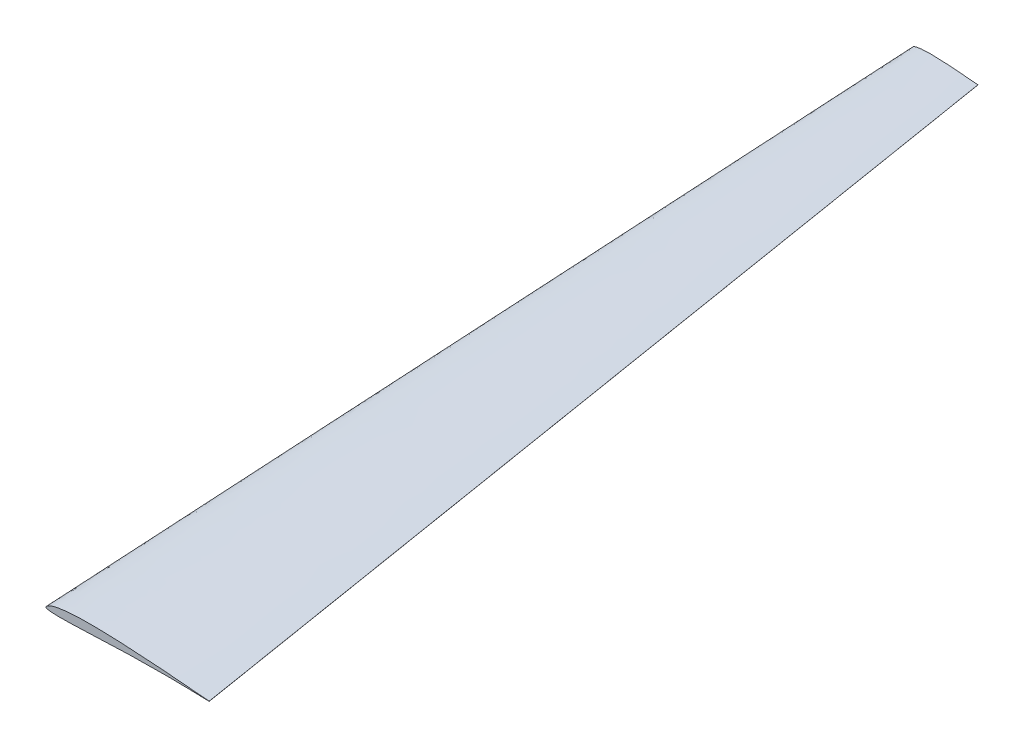
ISO-10303-21;
HEADER;
FILE_DESCRIPTION(('STEP AP214'),'2;1');
FILE_NAME('part.step','',(''),(''),'','','');
FILE_SCHEMA(('AUTOMOTIVE_DESIGN { 1 0 10303 214 1 1 1 1 }'));
ENDSEC;
DATA;
#1=APPLICATION_CONTEXT('core data for automotive mechanical design processes');
#2=APPLICATION_PROTOCOL_DEFINITION('international standard','automotive_design',2000,#1);
#3=PRODUCT_CONTEXT('',#1,'mechanical');
#4=PRODUCT('Part','Part','',(#3));
#5=PRODUCT_RELATED_PRODUCT_CATEGORY('part','',(#4));
#6=PRODUCT_DEFINITION_FORMATION('','',#4);
#7=PRODUCT_DEFINITION_CONTEXT('part definition',#1,'design');
#8=PRODUCT_DEFINITION('design','',#6,#7);
#9=PRODUCT_DEFINITION_SHAPE('','',#8);
#10=(LENGTH_UNIT() NAMED_UNIT(*) SI_UNIT(.MILLI.,.METRE.));
#11=(NAMED_UNIT(*) PLANE_ANGLE_UNIT() SI_UNIT($,.RADIAN.));
#12=(NAMED_UNIT(*) SI_UNIT($,.STERADIAN.) SOLID_ANGLE_UNIT());
#13=UNCERTAINTY_MEASURE_WITH_UNIT(LENGTH_MEASURE(1.E-05),#10,'distance_accuracy_value','');
#14=(GEOMETRIC_REPRESENTATION_CONTEXT(3) GLOBAL_UNCERTAINTY_ASSIGNED_CONTEXT((#13)) GLOBAL_UNIT_ASSIGNED_CONTEXT((#10,
#11,#12)) REPRESENTATION_CONTEXT('',''));
#15=CARTESIAN_POINT('',(0.,0.,0.));
#16=DIRECTION('',(0.,0.,1.));
#17=DIRECTION('',(1.,0.,0.));
#18=AXIS2_PLACEMENT_3D('',#15,#16,#17);
#19=CARTESIAN_POINT('',(60.0537332262467,91.7339972019544,-471.181048054879));
#20=DIRECTION('',(0.,0.,-1.));
#21=DIRECTION('',(-1.,0.,0.));
#22=AXIS2_PLACEMENT_3D('',#19,#20,#21);
#23=PLANE('',#22);
#24=CARTESIAN_POINT('',(99.9999999999999,91.6071177807418,-471.181048054879));
#25=CARTESIAN_POINT('',(96.8130845421146,91.9159161264516,-471.181048054879));
#26=CARTESIAN_POINT('',(90.8516017774765,92.4239674434614,-471.181048054879));
#27=CARTESIAN_POINT('',(83.0425550712482,93.0205608630696,-471.181048054879));
#28=CARTESIAN_POINT('',(76.7662191941969,93.3726710123304,-471.181048054879));
#29=CARTESIAN_POINT('',(71.9857527432553,93.5113728009834,-471.181048054879));
#30=CARTESIAN_POINT('',(68.1511854600101,93.4632955275076,-471.181048054879));
#31=CARTESIAN_POINT('',(65.4489732022514,93.2824054825393,-471.181048054879));
#32=CARTESIAN_POINT('',(63.5228856187694,93.0359983920731,-471.181048054879));
#33=CARTESIAN_POINT('',(62.0660229834825,92.7412102788768,-471.181048054879));
#34=CARTESIAN_POINT('',(60.9781681661375,92.3972311290684,-471.181048054879));
#35=CARTESIAN_POINT('',(60.3272429311943,92.0202378313688,-471.181048054879));
#36=CARTESIAN_POINT('',(60.070984151851,91.7932099307185,-471.181048054879));
#37=CARTESIAN_POINT('',(59.9677606236837,91.5582979381846,-471.181048054879));
#38=CARTESIAN_POINT('',(60.259069260349,91.2563320838473,-471.181048054879));
#39=CARTESIAN_POINT('',(61.0638038341098,91.1285470761483,-471.181048054879));
#40=CARTESIAN_POINT('',(62.6625241862733,90.9022574837296,-471.181048054879));
#41=CARTESIAN_POINT('',(69.5937623498145,90.84468793336,-471.181048054879));
#42=CARTESIAN_POINT('',(78.033126521504,91.4353540552512,-471.181048054879));
#43=CARTESIAN_POINT('',(89.7307037407105,91.7487402009355,-471.181048054879));
#44=CARTESIAN_POINT('',(95.8836565315395,91.6737997241128,-471.181048054879));
#45=CARTESIAN_POINT('',(99.9999999999999,91.5695177807418,-471.181048054879));
#46=B_SPLINE_CURVE_WITH_KNOTS('',3,(#24,#25,#26,#27,#28,#29,#30,#31,#32,#33,#34,#35,#36,#37,#38,
#39,#40,#41,#42,#43,#44,#45),.UNSPECIFIED.,.F.,.F.,(4,1,1,1,1,1,1,1,1,1,1,1,1,1,1,1,1,1,1,4),
(0.,0.119083164717175,0.222520124433715,0.2912733453482,0.352866803612905,0.400365287570826,
0.433855393085576,0.453552748389118,0.472540106699217,0.489120782233272,0.495803553550714,
0.500290804141686,0.501939697087531,0.504569258270676,0.514306552104738,0.531773804943749,
0.564929640012207,0.771159197280141,0.846855431295102,1.),.UNSPECIFIED.);
#47=CARTESIAN_POINT('',(99.9999999999999,91.6071177807418,-471.181048054879));
#48=VERTEX_POINT('',#47);
#49=CARTESIAN_POINT('',(99.9999999999999,91.5695177807418,-471.181048054879));
#50=VERTEX_POINT('',#49);
#51=EDGE_CURVE('E59',#48,#50,#46,.T.);
#52=ORIENTED_EDGE('',*,*,#51,.F.);
#53=DIRECTION('',(0.,1.,0.));
#54=VECTOR('',#53,1.);
#55=CARTESIAN_POINT('',(99.9999999999999,91.6071177807418,-471.181048054879));
#56=LINE('',#55,#54);
#57=EDGE_CURVE('E12',#50,#48,#56,.T.);
#58=ORIENTED_EDGE('',*,*,#57,.F.);
#59=EDGE_LOOP('',(#52,#58));
#60=FACE_BOUND('',#59,.T.);
#61=ADVANCED_FACE('F49',(#60),#23,.T.);
#62=CARTESIAN_POINT('',(0.149701114740626,0.382710896466182,0.));
#63=DIRECTION('',(0.,0.,-1.));
#64=DIRECTION('',(-1.,0.,0.));
#65=AXIS2_PLACEMENT_3D('',#62,#63,#64);
#66=PLANE('',#65);
#67=CARTESIAN_POINT('',(100.,0.048,0.));
#68=CARTESIAN_POINT('',(95.7678090600866,0.466238224355455,0.));
#69=CARTESIAN_POINT('',(86.9629866780535,1.28166045616531,0.));
#70=CARTESIAN_POINT('',(73.5755783965031,2.33883275981655,0.));
#71=CARTESIAN_POINT('',(60.7669928543316,3.25411780684955,0.));
#72=CARTESIAN_POINT('',(49.7892813180739,3.89651845544394,0.));
#73=CARTESIAN_POINT('',(41.1057660236439,4.29113693338756,0.));
#74=CARTESIAN_POINT('',(33.8066649059363,4.51482650584163,0.));
#75=CARTESIAN_POINT('',(27.4373491993857,4.59265437301291,0.));
#76=CARTESIAN_POINT('',(21.998770095792,4.52893409379901,0.));
#77=CARTESIAN_POINT('',(17.4976897869706,4.35664490194256,0.));
#78=CARTESIAN_POINT('',(13.9280867229625,4.11310217417087,0.));
#79=CARTESIAN_POINT('',(10.8450947445525,3.79431573645231,0.));
#80=CARTESIAN_POINT('',(8.25973648829716,3.43168371237338,0.));
#81=CARTESIAN_POINT('',(5.77165713087808,2.95553363332165,0.));
#82=CARTESIAN_POINT('',(3.81117060933852,2.42957189849011,0.));
#83=CARTESIAN_POINT('',(2.41154339976418,1.90940296795387,0.));
#84=CARTESIAN_POINT('',(1.57367642550033,1.51396632316191,0.));
#85=CARTESIAN_POINT('',(0.858740558425748,1.08233501808922,0.));
#86=CARTESIAN_POINT('',(0.383566207503347,0.696150878405413,0.));
#87=CARTESIAN_POINT('',(0.0958470335564905,0.317390082474438,0.));
#88=CARTESIAN_POINT('',(-0.0550932331423856,0.0190598725395283,0.));
#89=CARTESIAN_POINT('',(0.136376617653543,-0.363613561370544,0.));
#90=CARTESIAN_POINT('',(0.747212216913425,-0.607184857095697,0.));
#91=CARTESIAN_POINT('',(1.93249874260405,-0.906672696361201,0.));
#92=CARTESIAN_POINT('',(3.86687959928018,-1.09235728611324,0.));
#93=CARTESIAN_POINT('',(7.22304271249356,-1.23682821475079,0.));
#94=CARTESIAN_POINT('',(19.9703151830104,-1.10889854136353,0.));
#95=CARTESIAN_POINT('',(35.9410412081646,-0.168776381389414,0.));
#96=CARTESIAN_POINT('',(54.2652047081026,0.351310350403022,0.));
#97=CARTESIAN_POINT('',(66.6316613433748,0.514205727253173,0.));
#98=CARTESIAN_POINT('',(81.8797164032217,0.491571987868032,0.));
#99=CARTESIAN_POINT('',(93.0002985756747,0.162951507878686,0.));
#100=CARTESIAN_POINT('',(100.,-0.048,0.));
#101=B_SPLINE_CURVE_WITH_KNOTS('',3,(#67,#68,#69,#70,#71,#72,#73,#74,#75,#76,#77,#78,#79,#80,
#81,#82,#83,#84,#85,#86,#87,#88,#89,#90,#91,#92,#93,#94,#95,#96,#97,#98,#99,#100),.UNSPECIFIED.,
.F.,.F.,(4,1,1,1,1,1,1,1,1,1,1,1,1,1,1,1,1,1,1,1,1,1,1,1,1,1,1,1,1,1,1,4),(0.,
0.0633097082857943,0.131633986730062,0.199908609543976,0.254470331626873,0.295330225307067,
0.329306897662911,0.363176582509545,0.39014915066856,0.410267165680514,0.430225594155254,
0.443403078861375,0.456401114102058,0.469079226495508,0.481100550345541,0.48657500830179,
0.491291363916925,0.494859816059391,0.499017562017258,0.500262083754764,0.502010582647247,
0.503626680353124,0.506125425246534,0.511427032365495,0.52203816886627,0.534830952324052,
0.561519443882228,0.711640927785456,0.773024385371238,0.834387923705442,0.895751228796987,1.),.UNSPECIFIED.);
#102=CARTESIAN_POINT('',(100.,0.048,0.));
#103=VERTEX_POINT('',#102);
#104=CARTESIAN_POINT('',(100.,-0.048,0.));
#105=VERTEX_POINT('',#104);
#106=EDGE_CURVE('E84',#103,#105,#101,.T.);
#107=ORIENTED_EDGE('',*,*,#106,.T.);
#108=DIRECTION('',(0.,1.,0.));
#109=VECTOR('',#108,1.);
#110=CARTESIAN_POINT('',(100.,0.048,0.));
#111=LINE('',#110,#109);
#112=EDGE_CURVE('E81',#105,#103,#111,.T.);
#113=ORIENTED_EDGE('',*,*,#112,.T.);
#114=EDGE_LOOP('',(#107,#113));
#115=FACE_BOUND('',#114,.T.);
#116=ADVANCED_FACE('F83',(#115),#66,.F.);
#117=CARTESIAN_POINT('',(100.,-0.048,0.));
#118=CARTESIAN_POINT('',(99.9999999999999,91.5695177807418,-471.181048054879));
#119=CARTESIAN_POINT('',(93.0002985756747,0.162951507878686,0.));
#120=CARTESIAN_POINT('',(97.197917287792,91.6405047216893,-471.181048054879));
#121=CARTESIAN_POINT('',(82.7168893059387,0.466832980785614,0.));
#122=CARTESIAN_POINT('',(93.0806696511828,91.7079389708261,-471.181048054879));
#123=CARTESIAN_POINT('',(71.5915767740015,0.506843382823767,0.));
#124=CARTESIAN_POINT('',(88.6278420307327,91.6831230467413,-471.181048054879));
#125=CARTESIAN_POINT('',(63.3473923147981,0.470944164392769,0.));
#126=CARTESIAN_POINT('',(85.3281016441376,91.6302514682909,-471.181048054879));
#127=CARTESIAN_POINT('',(58.2629717785414,0.403970363914153,0.));
#128=CARTESIAN_POINT('',(83.2932171629245,91.572497683076,-471.181048054879));
#129=CARTESIAN_POINT('',(50.0191535641204,0.230796534724355,0.));
#130=CARTESIAN_POINT('',(79.9962406272894,91.4469754339773,-471.181048054879));
#131=CARTESIAN_POINT('',(36.0449860620477,-0.1695768621356,0.));
#132=CARTESIAN_POINT('',(74.4114477532867,91.1818748938785,-471.181048054879));
#133=CARTESIAN_POINT('',(21.9884140391992,-0.990102473311691,0.));
#134=CARTESIAN_POINT('',(68.7858569107294,90.8982687169052,-471.181048054879));
#135=CARTESIAN_POINT('',(10.1066994297021,-1.20788827776845,0.));
#136=CARTESIAN_POINT('',(64.0189986064804,90.8917875076642,-471.181048054879));
#137=CARTESIAN_POINT('',(7.87758385135069,-1.23025934016949,0.));
#138=CARTESIAN_POINT('',(63.1253674153313,90.9055685011521,-471.181048054879));
#139=CARTESIAN_POINT('',(5.23010180265256,-1.15103917105654,0.));
#140=CARTESIAN_POINT('',(62.0716685395971,90.997160306363,-471.181048054879));
#141=CARTESIAN_POINT('',(3.85393943426812,-1.08223488266522,0.));
#142=CARTESIAN_POINT('',(61.5264898227255,91.063056558285,-471.181048054879));
#143=CARTESIAN_POINT('',(2.48380076669902,-0.959593138486257,0.));
#144=CARTESIAN_POINT('',(60.9840311444914,91.1432259355077,-471.181048054879));
#145=CARTESIAN_POINT('',(1.43475619654622,-0.780907460362661,0.));
#146=CARTESIAN_POINT('',(60.5567615533005,91.2092402795877,-471.181048054879));
#147=CARTESIAN_POINT('',(0.807893074101635,-0.622517165706467,0.));
#148=CARTESIAN_POINT('',(60.3060924333925,91.2836190469463,-471.181048054879));
#149=CARTESIAN_POINT('',(0.302355325607625,-0.429797734343021,0.));
#150=CARTESIAN_POINT('',(60.1276264682424,91.4061028637593,-471.181048054879));
#151=CARTESIAN_POINT('',(0.0855593389568741,-0.26204967306133,0.));
#152=CARTESIAN_POINT('',(60.0386279039241,91.4850670036575,-471.181048054879));
#153=CARTESIAN_POINT('',(-0.000310073237934891,-0.0904302630297762,0.));
#154=CARTESIAN_POINT('',(60.002268349643,91.5445151352288,-471.181048054879));
#155=CARTESIAN_POINT('',(0.000148461623412831,0.126385022200043,0.));
#156=CARTESIAN_POINT('',(59.9978911760721,91.6268678487793,-471.181048054879));
#157=CARTESIAN_POINT('',(0.0567770248508426,0.239087323240239,0.));
#158=CARTESIAN_POINT('',(60.018481217654,91.6737258450156,-471.181048054879));
#159=CARTESIAN_POINT('',(0.165044265057758,0.408483067763215,0.));
#160=CARTESIAN_POINT('',(60.059454707416,91.7447751455079,-471.181048054879));
#161=CARTESIAN_POINT('',(0.345593863127384,0.646163124089597,0.));
#162=CARTESIAN_POINT('',(60.1299850937823,91.8454572075797,-471.181048054879));
#163=CARTESIAN_POINT('',(0.619732226961558,0.888087945021014,0.));
#164=CARTESIAN_POINT('',(60.2401141013515,91.9385930703037,-471.181048054879));
#165=CARTESIAN_POINT('',(1.04341405731988,1.193828743626,0.));
#166=CARTESIAN_POINT('',(60.407584393656,92.059929749743,-471.181048054879));
#167=CARTESIAN_POINT('',(1.42739897034917,1.42565360620737,0.));
#168=CARTESIAN_POINT('',(60.5608912861256,92.1543194806107,-471.181048054879));
#169=CARTESIAN_POINT('',(1.92315342573354,1.67890421503383,0.));
#170=CARTESIAN_POINT('',(60.7589032638427,92.2581210932788,-471.181048054879));
#171=CARTESIAN_POINT('',(2.54831570255545,1.96023414784466,0.));
#172=CARTESIAN_POINT('',(61.00720405172,92.3745564973329,-471.181048054879));
#173=CARTESIAN_POINT('',(3.59309424819023,2.34852421180772,0.));
#174=CARTESIAN_POINT('',(61.4226342272762,92.5360481581661,-471.181048054879));
#175=CARTESIAN_POINT('',(4.72305938447792,2.67421454044467,0.));
#176=CARTESIAN_POINT('',(61.8755287468959,92.6674124627069,-471.181048054879));
#177=CARTESIAN_POINT('',(6.33665691171791,3.06365907936456,0.));
#178=CARTESIAN_POINT('',(62.5200193301256,92.8294289384638,-471.181048054879));
#179=CARTESIAN_POINT('',(7.58984584995001,3.30348503597108,0.));
#180=CARTESIAN_POINT('',(63.0202556398708,92.9314267557585,-471.181048054879));
#181=CARTESIAN_POINT('',(9.2928833511539,3.57659675765137,0.));
#182=CARTESIAN_POINT('',(63.7005936154887,93.0478174802202,-471.181048054879));
#183=CARTESIAN_POINT('',(10.7937990967042,3.78107720753713,0.));
#184=CARTESIAN_POINT('',(64.300448600094,93.1354731166524,-471.181048054879));
#185=CARTESIAN_POINT('',(12.351756962279,3.95010708608855,0.));
#186=CARTESIAN_POINT('',(64.923641729897,93.2079126856037,-471.181048054879));
#187=CARTESIAN_POINT('',(14.5680667123463,4.15676598483524,0.));
#188=CARTESIAN_POINT('',(65.810123945437,93.2975334727406,-471.181048054879));
#189=CARTESIAN_POINT('',(16.8129036157681,4.30992410719746,0.));
#190=CARTESIAN_POINT('',(66.7081484710751,93.3651497220326,-471.181048054879));
#191=CARTESIAN_POINT('',(19.5022478659582,4.43337396869154,0.));
#192=CARTESIAN_POINT('',(67.7843717180049,93.4201155714188,-471.181048054879));
#193=CARTESIAN_POINT('',(22.6639376982754,4.53672742815105,0.));
#194=CARTESIAN_POINT('',(69.0496064132067,93.4676302230899,-471.181048054879));
#195=CARTESIAN_POINT('',(25.8546912448146,4.57411140345332,0.));
#196=CARTESIAN_POINT('',(70.3267065678247,93.4866821148934,-471.181048054879));
#197=CARTESIAN_POINT('',(29.9417336118154,4.56205282861216,0.));
#198=CARTESIAN_POINT('',(71.962696755665,93.4840282406162,-471.181048054879));
#199=CARTESIAN_POINT('',(34.4989168974892,4.49361162615661,0.));
#200=CARTESIAN_POINT('',(73.7867294325606,93.4575381992486,-471.181048054879));
#201=CARTESIAN_POINT('',(38.6346209293449,4.36686809270452,0.));
#202=CARTESIAN_POINT('',(75.4420322568446,93.40352876583,-471.181048054879));
#203=CARTESIAN_POINT('',(43.6580790258277,4.17514820785338,0.));
#204=CARTESIAN_POINT('',(77.452538770689,93.3211733188891,-471.181048054879));
#205=CARTESIAN_POINT('',(48.5439971277797,3.95039576899311,0.));
#206=CARTESIAN_POINT('',(79.4078467700969,93.224472461733,-471.181048054879));
#207=CARTESIAN_POINT('',(54.6720342222433,3.61078644087928,0.));
#208=CARTESIAN_POINT('',(81.8599774285855,93.0762788668723,-471.181048054879));
#209=CARTESIAN_POINT('',(62.9077944209465,3.10113888063353,0.));
#210=CARTESIAN_POINT('',(85.1553418879081,92.8559386040368,-471.181048054879));
#211=CARTESIAN_POINT('',(69.8385164681724,2.60587839819526,0.));
#212=CARTESIAN_POINT('',(87.9285282203926,92.6451002006032,-471.181048054879));
#213=CARTESIAN_POINT('',(78.9882678844777,1.91140533737536,0.));
#214=CARTESIAN_POINT('',(91.5896735021245,92.3522067239849,-471.181048054879));
#215=CARTESIAN_POINT('',(87.8024944778028,1.20391291124149,0.));
#216=CARTESIAN_POINT('',(95.1169694795309,92.0604629657811,-471.181048054879));
#217=CARTESIAN_POINT('',(95.7678090600866,0.466238224355455,0.));
#218=CARTESIAN_POINT('',(98.3056993114904,91.7712882009053,-471.181048054879));
#219=CARTESIAN_POINT('',(100.,0.048,0.));
#220=CARTESIAN_POINT('',(99.9999999999999,91.6071177807418,-471.181048054879));
#221=B_SPLINE_SURFACE_WITH_KNOTS('',3,1,((#117,#118),(#119,#120),(#121,#122),(#123,#124),(#125,
#126),(#127,#128),(#129,#130),(#131,#132),(#133,#134),(#135,#136),(#137,#138),(#139,#140),(#141,
#142),(#143,#144),(#145,#146),(#147,#148),(#149,#150),(#151,#152),(#153,#154),(#155,#156),(#157,
#158),(#159,#160),(#161,#162),(#163,#164),(#165,#166),(#167,#168),(#169,#170),(#171,#172),(#173,
#174),(#175,#176),(#177,#178),(#179,#180),(#181,#182),(#183,#184),(#185,#186),(#187,#188),(#189,
#190),(#191,#192),(#193,#194),(#195,#196),(#197,#198),(#199,#200),(#201,#202),(#203,#204),(#205,
#206),(#207,#208),(#209,#210),(#211,#212),(#213,#214),(#215,#216),(#217,#218),(#219,#220)),
.UNSPECIFIED.,.F.,.F.,.F.,(4,1,1,1,1,1,1,1,1,1,1,1,1,1,1,1,1,1,1,1,1,1,1,1,1,1,1,1,1,1,1,1,1,1,
1,1,1,1,1,1,1,1,1,1,1,1,1,1,1,4),(2,2),(0.,0.104248771203013,0.153144568704898,
0.165612076294558,0.226975614628762,0.228840802719859,0.288359072214544,0.435070359987793,
0.438480556117772,0.465169047675948,0.468226195056251,0.47796183113373,0.485693447895262,
0.488572967634505,0.493874574753466,0.495430741729324,0.496373319646876,0.497989417352753,
0.498060302912469,0.499709195858314,0.499737916245236,0.500982437982742,0.504196446449286,
0.505140183940609,0.508708636083075,0.510879217766728,0.51342499169821,0.518899449654459,
0.527459893300783,0.530920773504493,0.543598885897942,0.546447251610882,0.556596921138625,
0.566144606914424,0.569774405844746,0.589732834319486,0.599634712429174,0.60985084933144,
0.636823417490455,0.647133196387095,0.670693102337089,0.704669774692933,0.7087266546518,
0.745529668373127,0.777479875566285,0.800091390456024,0.868366013269938,0.880916835282825,
0.936690291714206,1.),(0.,1.),.UNSPECIFIED.);
#222=DIRECTION('',(0.,0.190750375847099,-0.981638576113526));
#223=VECTOR('',#222,1.);
#224=CARTESIAN_POINT('',(100.,45.8275588903709,-235.590524027439));
#225=LINE('',#224,#223);
#226=EDGE_CURVE('E72',#103,#48,#225,.T.);
#227=DIRECTION('',(0.,-0.190867612864741,0.981615787545879));
#228=VECTOR('',#227,1.);
#229=CARTESIAN_POINT('',(100.,45.7607588903709,-235.590524027439));
#230=LINE('',#229,#228);
#231=EDGE_CURVE('E89',#50,#105,#230,.T.);
#232=ORIENTED_EDGE('',*,*,#106,.F.);
#233=ORIENTED_EDGE('',*,*,#226,.T.);
#234=ORIENTED_EDGE('',*,*,#51,.T.);
#235=ORIENTED_EDGE('',*,*,#231,.T.);
#236=EDGE_LOOP('',(#232,#233,#234,#235));
#237=FACE_BOUND('',#236,.T.);
#238=ADVANCED_FACE('F94',(#237),#221,.T.);
#239=CARTESIAN_POINT('',(100.,0.,0.));
#240=DIRECTION('',(1.,0.,0.));
#241=DIRECTION('',(0.,0.,-1.));
#242=AXIS2_PLACEMENT_3D('',#239,#240,#241);
#243=PLANE('',#242);
#244=ORIENTED_EDGE('',*,*,#231,.F.);
#245=ORIENTED_EDGE('',*,*,#57,.T.);
#246=ORIENTED_EDGE('',*,*,#226,.F.);
#247=ORIENTED_EDGE('',*,*,#112,.F.);
#248=EDGE_LOOP('',(#244,#245,#246,#247));
#249=FACE_BOUND('',#248,.T.);
#250=ADVANCED_FACE('F98',(#249),#243,.T.);
#251=CLOSED_SHELL('',(#61,#116,#238,#250));
#252=MANIFOLD_SOLID_BREP('B2',#251);
#253=ADVANCED_BREP_SHAPE_REPRESENTATION('',(#18,#252),#14);
#254=SHAPE_DEFINITION_REPRESENTATION(#9,#253);
ENDSEC;
END-ISO-10303-21;
